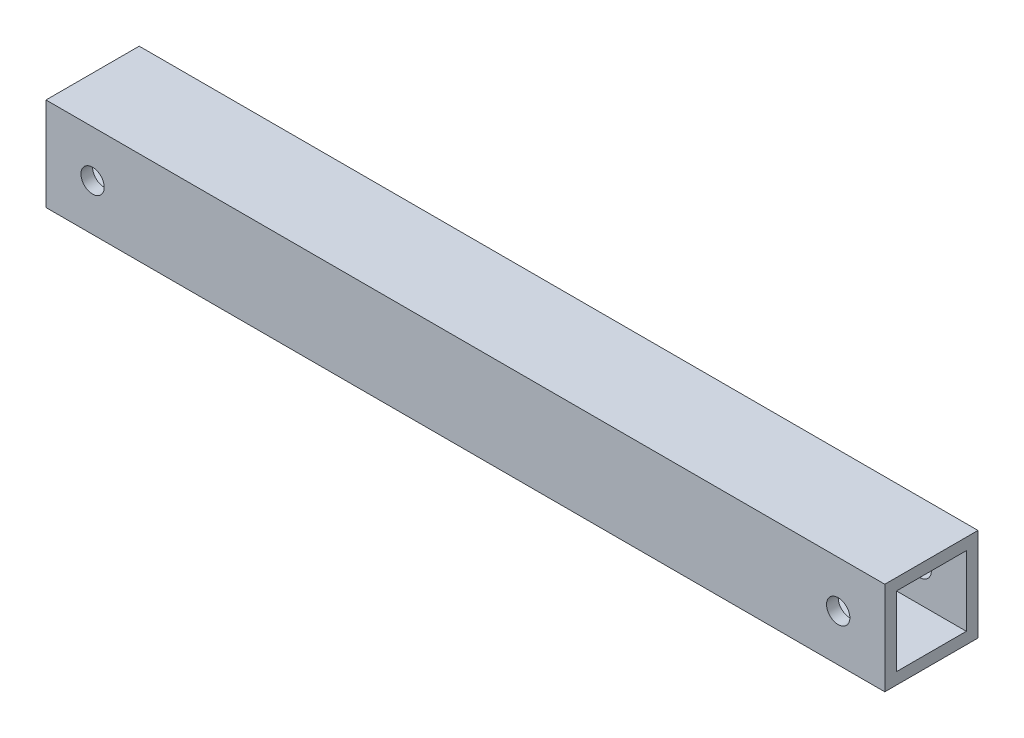
ISO-10303-21;
HEADER;
FILE_DESCRIPTION(('STEP AP214'),'2;1');
FILE_NAME('part.step','',(''),(''),'','','');
FILE_SCHEMA(('AUTOMOTIVE_DESIGN { 1 0 10303 214 1 1 1 1 }'));
ENDSEC;
DATA;
#1=APPLICATION_CONTEXT('core data for automotive mechanical design processes');
#2=APPLICATION_PROTOCOL_DEFINITION('international standard','automotive_design',2000,#1);
#3=PRODUCT_CONTEXT('',#1,'mechanical');
#4=PRODUCT('Part','Part','',(#3));
#5=PRODUCT_RELATED_PRODUCT_CATEGORY('part','',(#4));
#6=PRODUCT_DEFINITION_FORMATION('','',#4);
#7=PRODUCT_DEFINITION_CONTEXT('part definition',#1,'design');
#8=PRODUCT_DEFINITION('design','',#6,#7);
#9=PRODUCT_DEFINITION_SHAPE('','',#8);
#10=(LENGTH_UNIT() NAMED_UNIT(*) SI_UNIT(.MILLI.,.METRE.));
#11=(NAMED_UNIT(*) PLANE_ANGLE_UNIT() SI_UNIT($,.RADIAN.));
#12=(NAMED_UNIT(*) SI_UNIT($,.STERADIAN.) SOLID_ANGLE_UNIT());
#13=UNCERTAINTY_MEASURE_WITH_UNIT(LENGTH_MEASURE(1.E-05),#10,'distance_accuracy_value','');
#14=(GEOMETRIC_REPRESENTATION_CONTEXT(3) GLOBAL_UNCERTAINTY_ASSIGNED_CONTEXT((#13)) GLOBAL_UNIT_ASSIGNED_CONTEXT((#10,
#11,#12)) REPRESENTATION_CONTEXT('',''));
#15=CARTESIAN_POINT('',(0.,0.,0.));
#16=DIRECTION('',(0.,0.,1.));
#17=DIRECTION('',(1.,0.,0.));
#18=AXIS2_PLACEMENT_3D('',#15,#16,#17);
#19=CARTESIAN_POINT('',(114.3,-12.7,25.4));
#20=DIRECTION('',(-1.,0.,0.));
#21=DIRECTION('',(0.,0.,1.));
#22=AXIS2_PLACEMENT_3D('',#19,#20,#21);
#23=PLANE('',#22);
#24=DIRECTION('',(0.,1.,0.));
#25=VECTOR('',#24,1.);
#26=CARTESIAN_POINT('',(114.3,-12.7,0.));
#27=LINE('',#26,#25);
#28=CARTESIAN_POINT('',(114.3,-12.7,0.));
#29=VERTEX_POINT('',#28);
#30=CARTESIAN_POINT('',(114.3,12.7,0.));
#31=VERTEX_POINT('',#30);
#32=EDGE_CURVE('E122',#29,#31,#27,.T.);
#33=ORIENTED_EDGE('',*,*,#32,.T.);
#34=DIRECTION('',(0.,0.,-1.));
#35=VECTOR('',#34,1.);
#36=CARTESIAN_POINT('',(114.3,12.7,25.4));
#37=LINE('',#36,#35);
#38=CARTESIAN_POINT('',(114.3,12.7,25.4));
#39=VERTEX_POINT('',#38);
#40=EDGE_CURVE('E151',#39,#31,#37,.T.);
#41=ORIENTED_EDGE('',*,*,#40,.F.);
#42=DIRECTION('',(0.,1.,0.));
#43=VECTOR('',#42,1.);
#44=CARTESIAN_POINT('',(114.3,-12.7,25.4));
#45=LINE('',#44,#43);
#46=CARTESIAN_POINT('',(114.3,-12.7,25.4));
#47=VERTEX_POINT('',#46);
#48=EDGE_CURVE('E125',#47,#39,#45,.T.);
#49=ORIENTED_EDGE('',*,*,#48,.F.);
#50=DIRECTION('',(0.,0.,-1.));
#51=VECTOR('',#50,1.);
#52=CARTESIAN_POINT('',(114.3,-12.7,25.4));
#53=LINE('',#52,#51);
#54=EDGE_CURVE('E135',#47,#29,#53,.T.);
#55=ORIENTED_EDGE('',*,*,#54,.T.);
#56=EDGE_LOOP('',(#33,#41,#49,#55));
#57=FACE_BOUND('',#56,.T.);
#58=DIRECTION('',(0.,0.,-1.));
#59=VECTOR('',#58,1.);
#60=CARTESIAN_POINT('',(114.3,9.52035864154581,0.));
#61=LINE('',#60,#59);
#62=CARTESIAN_POINT('',(114.3,9.52035864154581,22.225));
#63=VERTEX_POINT('',#62);
#64=CARTESIAN_POINT('',(114.3,9.52035864154581,3.175));
#65=VERTEX_POINT('',#64);
#66=EDGE_CURVE('E49',#63,#65,#61,.T.);
#67=ORIENTED_EDGE('',*,*,#66,.T.);
#68=DIRECTION('',(0.,1.,0.));
#69=VECTOR('',#68,1.);
#70=CARTESIAN_POINT('',(114.3,0.,3.175));
#71=LINE('',#70,#69);
#72=CARTESIAN_POINT('',(114.3,-9.52035864154582,3.175));
#73=VERTEX_POINT('',#72);
#74=EDGE_CURVE('E115',#73,#65,#71,.T.);
#75=ORIENTED_EDGE('',*,*,#74,.F.);
#76=DIRECTION('',(0.,0.,-1.));
#77=VECTOR('',#76,1.);
#78=CARTESIAN_POINT('',(114.3,-9.52035864154582,0.));
#79=LINE('',#78,#77);
#80=CARTESIAN_POINT('',(114.3,-9.52035864154582,22.225));
#81=VERTEX_POINT('',#80);
#82=EDGE_CURVE('E101',#81,#73,#79,.T.);
#83=ORIENTED_EDGE('',*,*,#82,.F.);
#84=DIRECTION('',(0.,1.,0.));
#85=VECTOR('',#84,1.);
#86=CARTESIAN_POINT('',(114.3,0.,22.225));
#87=LINE('',#86,#85);
#88=EDGE_CURVE('E110',#81,#63,#87,.T.);
#89=ORIENTED_EDGE('',*,*,#88,.T.);
#90=EDGE_LOOP('',(#67,#75,#83,#89));
#91=FACE_BOUND('',#90,.T.);
#92=ADVANCED_FACE('F33',(#57,#91),#23,.F.);
#93=CARTESIAN_POINT('',(-114.3,-12.7,25.4));
#94=DIRECTION('',(1.,0.,0.));
#95=DIRECTION('',(0.,0.,-1.));
#96=AXIS2_PLACEMENT_3D('',#93,#94,#95);
#97=PLANE('',#96);
#98=DIRECTION('',(0.,-1.,0.));
#99=VECTOR('',#98,1.);
#100=CARTESIAN_POINT('',(-114.3,-12.7,0.));
#101=LINE('',#100,#99);
#102=CARTESIAN_POINT('',(-114.3,12.7,0.));
#103=VERTEX_POINT('',#102);
#104=CARTESIAN_POINT('',(-114.3,-12.7,0.));
#105=VERTEX_POINT('',#104);
#106=EDGE_CURVE('E140',#103,#105,#101,.T.);
#107=ORIENTED_EDGE('',*,*,#106,.T.);
#108=DIRECTION('',(0.,0.,-1.));
#109=VECTOR('',#108,1.);
#110=CARTESIAN_POINT('',(-114.3,-12.7,25.4));
#111=LINE('',#110,#109);
#112=CARTESIAN_POINT('',(-114.3,-12.7,25.4));
#113=VERTEX_POINT('',#112);
#114=EDGE_CURVE('E145',#113,#105,#111,.T.);
#115=ORIENTED_EDGE('',*,*,#114,.F.);
#116=DIRECTION('',(0.,-1.,0.));
#117=VECTOR('',#116,1.);
#118=CARTESIAN_POINT('',(-114.3,-12.7,25.4));
#119=LINE('',#118,#117);
#120=CARTESIAN_POINT('',(-114.3,12.7,25.4));
#121=VERTEX_POINT('',#120);
#122=EDGE_CURVE('E131',#121,#113,#119,.T.);
#123=ORIENTED_EDGE('',*,*,#122,.F.);
#124=DIRECTION('',(0.,0.,-1.));
#125=VECTOR('',#124,1.);
#126=CARTESIAN_POINT('',(-114.3,12.7,25.4));
#127=LINE('',#126,#125);
#128=EDGE_CURVE('E148',#121,#103,#127,.T.);
#129=ORIENTED_EDGE('',*,*,#128,.T.);
#130=EDGE_LOOP('',(#107,#115,#123,#129));
#131=FACE_BOUND('',#130,.T.);
#132=DIRECTION('',(0.,0.,-1.));
#133=VECTOR('',#132,1.);
#134=CARTESIAN_POINT('',(-114.3,9.52035864154581,25.4));
#135=LINE('',#134,#133);
#136=CARTESIAN_POINT('',(-114.3,9.52035864154581,22.225));
#137=VERTEX_POINT('',#136);
#138=CARTESIAN_POINT('',(-114.3,9.52035864154581,3.175));
#139=VERTEX_POINT('',#138);
#140=EDGE_CURVE('E11',#137,#139,#135,.T.);
#141=ORIENTED_EDGE('',*,*,#140,.F.);
#142=DIRECTION('',(0.,1.,0.));
#143=VECTOR('',#142,1.);
#144=CARTESIAN_POINT('',(-114.3,-12.7,22.225));
#145=LINE('',#144,#143);
#146=CARTESIAN_POINT('',(-114.3,-9.52035864154582,22.225));
#147=VERTEX_POINT('',#146);
#148=EDGE_CURVE('E154',#147,#137,#145,.T.);
#149=ORIENTED_EDGE('',*,*,#148,.F.);
#150=DIRECTION('',(0.,0.,-1.));
#151=VECTOR('',#150,1.);
#152=CARTESIAN_POINT('',(-114.3,-9.52035864154582,25.4));
#153=LINE('',#152,#151);
#154=CARTESIAN_POINT('',(-114.3,-9.52035864154582,3.175));
#155=VERTEX_POINT('',#154);
#156=EDGE_CURVE('E104',#147,#155,#153,.T.);
#157=ORIENTED_EDGE('',*,*,#156,.T.);
#158=DIRECTION('',(0.,1.,0.));
#159=VECTOR('',#158,1.);
#160=CARTESIAN_POINT('',(-114.3,-12.7,3.175));
#161=LINE('',#160,#159);
#162=EDGE_CURVE('E41',#155,#139,#161,.T.);
#163=ORIENTED_EDGE('',*,*,#162,.T.);
#164=EDGE_LOOP('',(#141,#149,#157,#163));
#165=FACE_BOUND('',#164,.T.);
#166=ADVANCED_FACE('F208',(#131,#165),#97,.F.);
#167=CARTESIAN_POINT('',(-114.3,12.7,25.4));
#168=DIRECTION('',(0.,-1.,0.));
#169=DIRECTION('',(0.,0.,-1.));
#170=AXIS2_PLACEMENT_3D('',#167,#168,#169);
#171=PLANE('',#170);
#172=DIRECTION('',(-1.,0.,0.));
#173=VECTOR('',#172,1.);
#174=CARTESIAN_POINT('',(-114.3,12.7,0.));
#175=LINE('',#174,#173);
#176=EDGE_CURVE('E138',#31,#103,#175,.T.);
#177=ORIENTED_EDGE('',*,*,#176,.T.);
#178=ORIENTED_EDGE('',*,*,#128,.F.);
#179=DIRECTION('',(-1.,0.,0.));
#180=VECTOR('',#179,1.);
#181=CARTESIAN_POINT('',(-114.3,12.7,25.4));
#182=LINE('',#181,#180);
#183=EDGE_CURVE('E128',#39,#121,#182,.T.);
#184=ORIENTED_EDGE('',*,*,#183,.F.);
#185=ORIENTED_EDGE('',*,*,#40,.T.);
#186=EDGE_LOOP('',(#177,#178,#184,#185));
#187=FACE_BOUND('',#186,.T.);
#188=ADVANCED_FACE('F212',(#187),#171,.F.);
#189=CARTESIAN_POINT('',(-114.3,-12.7,25.4));
#190=DIRECTION('',(0.,1.,0.));
#191=DIRECTION('',(0.,0.,1.));
#192=AXIS2_PLACEMENT_3D('',#189,#190,#191);
#193=PLANE('',#192);
#194=DIRECTION('',(1.,0.,0.));
#195=VECTOR('',#194,1.);
#196=CARTESIAN_POINT('',(-114.3,-12.7,0.));
#197=LINE('',#196,#195);
#198=EDGE_CURVE('E129',#105,#29,#197,.T.);
#199=ORIENTED_EDGE('',*,*,#198,.T.);
#200=ORIENTED_EDGE('',*,*,#54,.F.);
#201=DIRECTION('',(1.,0.,0.));
#202=VECTOR('',#201,1.);
#203=CARTESIAN_POINT('',(-114.3,-12.7,25.4));
#204=LINE('',#203,#202);
#205=EDGE_CURVE('E133',#113,#47,#204,.T.);
#206=ORIENTED_EDGE('',*,*,#205,.F.);
#207=ORIENTED_EDGE('',*,*,#114,.T.);
#208=EDGE_LOOP('',(#199,#200,#206,#207));
#209=FACE_BOUND('',#208,.T.);
#210=ADVANCED_FACE('F204',(#209),#193,.F.);
#211=CARTESIAN_POINT('',(0.,0.,25.4));
#212=DIRECTION('',(0.,0.,-1.));
#213=DIRECTION('',(-1.,0.,0.));
#214=AXIS2_PLACEMENT_3D('',#211,#212,#213);
#215=PLANE('',#214);
#216=CARTESIAN_POINT('',(-101.6,0.,25.4));
#217=DIRECTION('',(0.,0.,1.));
#218=DIRECTION('',(1.,0.,0.));
#219=AXIS2_PLACEMENT_3D('',#216,#217,#218);
#220=CIRCLE('',#219,3.175);
#221=CARTESIAN_POINT('',(-98.425,0.,25.4));
#222=VERTEX_POINT('',#221);
#223=EDGE_CURVE('E161',#222,#222,#220,.T.);
#224=ORIENTED_EDGE('',*,*,#223,.F.);
#225=EDGE_LOOP('',(#224));
#226=FACE_BOUND('',#225,.T.);
#227=CARTESIAN_POINT('',(101.6,0.,25.4));
#228=DIRECTION('',(0.,0.,1.));
#229=DIRECTION('',(1.,0.,0.));
#230=AXIS2_PLACEMENT_3D('',#227,#228,#229);
#231=CIRCLE('',#230,3.175);
#232=CARTESIAN_POINT('',(104.775,0.,25.4));
#233=VERTEX_POINT('',#232);
#234=EDGE_CURVE('E168',#233,#233,#231,.T.);
#235=ORIENTED_EDGE('',*,*,#234,.F.);
#236=EDGE_LOOP('',(#235));
#237=FACE_BOUND('',#236,.T.);
#238=ORIENTED_EDGE('',*,*,#48,.T.);
#239=ORIENTED_EDGE('',*,*,#183,.T.);
#240=ORIENTED_EDGE('',*,*,#122,.T.);
#241=ORIENTED_EDGE('',*,*,#205,.T.);
#242=EDGE_LOOP('',(#238,#239,#240,#241));
#243=FACE_BOUND('',#242,.T.);
#244=ADVANCED_FACE('F191',(#226,#237,#243),#215,.F.);
#245=CARTESIAN_POINT('',(0.,0.,0.));
#246=DIRECTION('',(0.,0.,-1.));
#247=DIRECTION('',(-1.,0.,0.));
#248=AXIS2_PLACEMENT_3D('',#245,#246,#247);
#249=PLANE('',#248);
#250=CARTESIAN_POINT('',(-101.6,0.,0.));
#251=DIRECTION('',(0.,0.,-1.));
#252=DIRECTION('',(-1.,0.,0.));
#253=AXIS2_PLACEMENT_3D('',#250,#251,#252);
#254=CIRCLE('',#253,3.175);
#255=CARTESIAN_POINT('',(-104.775,0.,0.));
#256=VERTEX_POINT('',#255);
#257=EDGE_CURVE('E180',#256,#256,#254,.T.);
#258=ORIENTED_EDGE('',*,*,#257,.F.);
#259=EDGE_LOOP('',(#258));
#260=FACE_BOUND('',#259,.T.);
#261=CARTESIAN_POINT('',(101.6,0.,0.));
#262=DIRECTION('',(0.,0.,-1.));
#263=DIRECTION('',(-1.,0.,0.));
#264=AXIS2_PLACEMENT_3D('',#261,#262,#263);
#265=CIRCLE('',#264,3.175);
#266=CARTESIAN_POINT('',(98.425,0.,0.));
#267=VERTEX_POINT('',#266);
#268=EDGE_CURVE('E165',#267,#267,#265,.T.);
#269=ORIENTED_EDGE('',*,*,#268,.F.);
#270=EDGE_LOOP('',(#269));
#271=FACE_BOUND('',#270,.T.);
#272=ORIENTED_EDGE('',*,*,#32,.F.);
#273=ORIENTED_EDGE('',*,*,#198,.F.);
#274=ORIENTED_EDGE('',*,*,#106,.F.);
#275=ORIENTED_EDGE('',*,*,#176,.F.);
#276=EDGE_LOOP('',(#272,#273,#274,#275));
#277=FACE_BOUND('',#276,.T.);
#278=ADVANCED_FACE('F187',(#260,#271,#277),#249,.T.);
#279=CARTESIAN_POINT('',(-393.7,9.52035864154581,0.));
#280=DIRECTION('',(0.,-1.,0.));
#281=DIRECTION('',(0.,0.,-1.));
#282=AXIS2_PLACEMENT_3D('',#279,#280,#281);
#283=PLANE('',#282);
#284=ORIENTED_EDGE('',*,*,#140,.T.);
#285=DIRECTION('',(1.,0.,0.));
#286=VECTOR('',#285,1.);
#287=CARTESIAN_POINT('',(-393.7,9.52035864154581,3.175));
#288=LINE('',#287,#286);
#289=EDGE_CURVE('E120',#139,#65,#288,.T.);
#290=ORIENTED_EDGE('',*,*,#289,.T.);
#291=ORIENTED_EDGE('',*,*,#66,.F.);
#292=DIRECTION('',(1.,0.,0.));
#293=VECTOR('',#292,1.);
#294=CARTESIAN_POINT('',(-393.7,9.52035864154581,22.225));
#295=LINE('',#294,#293);
#296=EDGE_CURVE('E107',#137,#63,#295,.T.);
#297=ORIENTED_EDGE('',*,*,#296,.F.);
#298=EDGE_LOOP('',(#284,#290,#291,#297));
#299=FACE_BOUND('',#298,.T.);
#300=ADVANCED_FACE('F190',(#299),#283,.T.);
#301=CARTESIAN_POINT('',(-393.7,0.,3.175));
#302=DIRECTION('',(0.,0.,-1.));
#303=DIRECTION('',(-1.,0.,0.));
#304=AXIS2_PLACEMENT_3D('',#301,#302,#303);
#305=PLANE('',#304);
#306=CARTESIAN_POINT('',(-101.6,0.,3.17499999999998));
#307=DIRECTION('',(0.,0.,-1.));
#308=DIRECTION('',(-1.,0.,0.));
#309=AXIS2_PLACEMENT_3D('',#306,#307,#308);
#310=CIRCLE('',#309,3.175);
#311=CARTESIAN_POINT('',(-104.775,0.,3.17499999999998));
#312=VERTEX_POINT('',#311);
#313=EDGE_CURVE('E177',#312,#312,#310,.T.);
#314=ORIENTED_EDGE('',*,*,#313,.T.);
#315=EDGE_LOOP('',(#314));
#316=FACE_BOUND('',#315,.T.);
#317=CARTESIAN_POINT('',(101.6,0.,3.17499999999998));
#318=DIRECTION('',(0.,0.,-1.));
#319=DIRECTION('',(-1.,0.,0.));
#320=AXIS2_PLACEMENT_3D('',#317,#318,#319);
#321=CIRCLE('',#320,3.175);
#322=CARTESIAN_POINT('',(98.425,0.,3.17499999999998));
#323=VERTEX_POINT('',#322);
#324=EDGE_CURVE('E160',#323,#323,#321,.T.);
#325=ORIENTED_EDGE('',*,*,#324,.T.);
#326=EDGE_LOOP('',(#325));
#327=FACE_BOUND('',#326,.T.);
#328=DIRECTION('',(1.,0.,0.));
#329=VECTOR('',#328,1.);
#330=CARTESIAN_POINT('',(-393.7,-9.52035864154582,3.175));
#331=LINE('',#330,#329);
#332=EDGE_CURVE('E106',#155,#73,#331,.T.);
#333=ORIENTED_EDGE('',*,*,#332,.T.);
#334=ORIENTED_EDGE('',*,*,#74,.T.);
#335=ORIENTED_EDGE('',*,*,#289,.F.);
#336=ORIENTED_EDGE('',*,*,#162,.F.);
#337=EDGE_LOOP('',(#333,#334,#335,#336));
#338=FACE_BOUND('',#337,.T.);
#339=ADVANCED_FACE('F256',(#316,#327,#338),#305,.F.);
#340=CARTESIAN_POINT('',(-393.7,-9.52035864154582,0.));
#341=DIRECTION('',(0.,-1.,0.));
#342=DIRECTION('',(0.,0.,-1.));
#343=AXIS2_PLACEMENT_3D('',#340,#341,#342);
#344=PLANE('',#343);
#345=DIRECTION('',(1.,0.,0.));
#346=VECTOR('',#345,1.);
#347=CARTESIAN_POINT('',(-393.7,-9.52035864154582,22.225));
#348=LINE('',#347,#346);
#349=EDGE_CURVE('E57',#147,#81,#348,.T.);
#350=ORIENTED_EDGE('',*,*,#349,.T.);
#351=ORIENTED_EDGE('',*,*,#82,.T.);
#352=ORIENTED_EDGE('',*,*,#332,.F.);
#353=ORIENTED_EDGE('',*,*,#156,.F.);
#354=EDGE_LOOP('',(#350,#351,#352,#353));
#355=FACE_BOUND('',#354,.T.);
#356=ADVANCED_FACE('F98',(#355),#344,.F.);
#357=CARTESIAN_POINT('',(-393.7,0.,22.225));
#358=DIRECTION('',(0.,0.,-1.));
#359=DIRECTION('',(0.,1.,0.));
#360=AXIS2_PLACEMENT_3D('',#357,#358,#359);
#361=PLANE('',#360);
#362=CARTESIAN_POINT('',(-101.6,0.,22.2250000000001));
#363=DIRECTION('',(0.,0.,-1.));
#364=DIRECTION('',(0.,1.,0.));
#365=AXIS2_PLACEMENT_3D('',#362,#363,#364);
#366=CIRCLE('',#365,3.175);
#367=CARTESIAN_POINT('',(-101.6,3.17499999999997,22.2250000000001));
#368=VERTEX_POINT('',#367);
#369=EDGE_CURVE('E36',#368,#368,#366,.T.);
#370=ORIENTED_EDGE('',*,*,#369,.F.);
#371=EDGE_LOOP('',(#370));
#372=FACE_BOUND('',#371,.T.);
#373=CARTESIAN_POINT('',(101.6,0.,22.2250000000001));
#374=DIRECTION('',(0.,0.,-1.));
#375=DIRECTION('',(0.,1.,0.));
#376=AXIS2_PLACEMENT_3D('',#373,#374,#375);
#377=CIRCLE('',#376,3.175);
#378=CARTESIAN_POINT('',(101.6,3.175,22.2250000000001));
#379=VERTEX_POINT('',#378);
#380=EDGE_CURVE('E158',#379,#379,#377,.T.);
#381=ORIENTED_EDGE('',*,*,#380,.F.);
#382=EDGE_LOOP('',(#381));
#383=FACE_BOUND('',#382,.T.);
#384=ORIENTED_EDGE('',*,*,#148,.T.);
#385=ORIENTED_EDGE('',*,*,#296,.T.);
#386=ORIENTED_EDGE('',*,*,#88,.F.);
#387=ORIENTED_EDGE('',*,*,#349,.F.);
#388=EDGE_LOOP('',(#384,#385,#386,#387));
#389=FACE_BOUND('',#388,.T.);
#390=ADVANCED_FACE('F111',(#372,#383,#389),#361,.T.);
#391=CARTESIAN_POINT('',(101.6,0.,-482.6));
#392=DIRECTION('',(0.,0.,1.));
#393=DIRECTION('',(1.,0.,0.));
#394=AXIS2_PLACEMENT_3D('',#391,#392,#393);
#395=CYLINDRICAL_SURFACE('',#394,3.175);
#396=ORIENTED_EDGE('',*,*,#380,.T.);
#397=EDGE_LOOP('',(#396));
#398=FACE_BOUND('',#397,.T.);
#399=ORIENTED_EDGE('',*,*,#234,.T.);
#400=EDGE_LOOP('',(#399));
#401=FACE_BOUND('',#400,.T.);
#402=ADVANCED_FACE('F289',(#398,#401),#395,.F.);
#403=CARTESIAN_POINT('',(-101.6,0.,-482.6));
#404=DIRECTION('',(0.,0.,1.));
#405=DIRECTION('',(1.,0.,0.));
#406=AXIS2_PLACEMENT_3D('',#403,#404,#405);
#407=CYLINDRICAL_SURFACE('',#406,3.175);
#408=ORIENTED_EDGE('',*,*,#369,.T.);
#409=EDGE_LOOP('',(#408));
#410=FACE_BOUND('',#409,.T.);
#411=ORIENTED_EDGE('',*,*,#223,.T.);
#412=EDGE_LOOP('',(#411));
#413=FACE_BOUND('',#412,.T.);
#414=ADVANCED_FACE('F299',(#410,#413),#407,.F.);
#415=ORIENTED_EDGE('',*,*,#268,.T.);
#416=EDGE_LOOP('',(#415));
#417=FACE_BOUND('',#416,.T.);
#418=ORIENTED_EDGE('',*,*,#324,.F.);
#419=EDGE_LOOP('',(#418));
#420=FACE_BOUND('',#419,.T.);
#421=ADVANCED_FACE('F301',(#417,#420),#395,.F.);
#422=ORIENTED_EDGE('',*,*,#257,.T.);
#423=EDGE_LOOP('',(#422));
#424=FACE_BOUND('',#423,.T.);
#425=ORIENTED_EDGE('',*,*,#313,.F.);
#426=EDGE_LOOP('',(#425));
#427=FACE_BOUND('',#426,.T.);
#428=ADVANCED_FACE('F184',(#424,#427),#407,.F.);
#429=CLOSED_SHELL('',(#92,#166,#188,#210,#244,#278,#300,#339,#356,#390,#402,#414,#421,#428));
#430=MANIFOLD_SOLID_BREP('B2',#429);
#431=ADVANCED_BREP_SHAPE_REPRESENTATION('',(#18,#430),#14);
#432=SHAPE_DEFINITION_REPRESENTATION(#9,#431);
ENDSEC;
END-ISO-10303-21;
